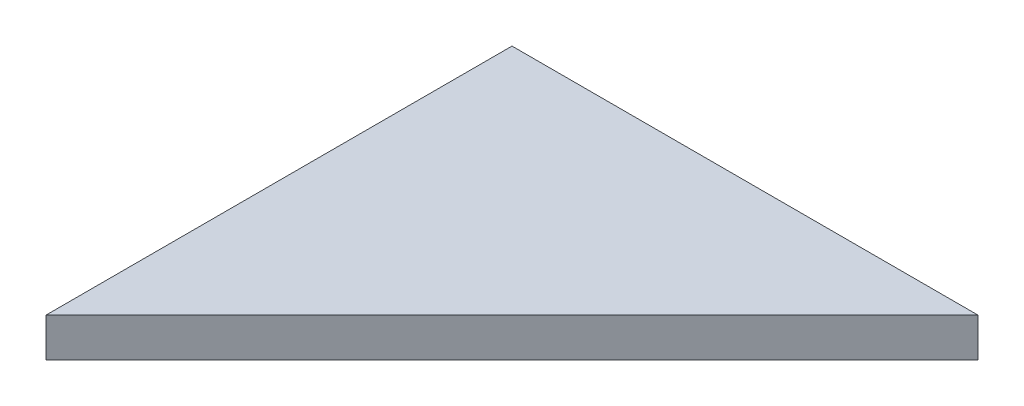
ISO-10303-21;
HEADER;
FILE_DESCRIPTION(('STEP AP214'),'2;1');
FILE_NAME('part.step','',(''),(''),'','','');
FILE_SCHEMA(('AUTOMOTIVE_DESIGN { 1 0 10303 214 1 1 1 1 }'));
ENDSEC;
DATA;
#1=APPLICATION_CONTEXT('core data for automotive mechanical design processes');
#2=APPLICATION_PROTOCOL_DEFINITION('international standard','automotive_design',2000,#1);
#3=PRODUCT_CONTEXT('',#1,'mechanical');
#4=PRODUCT('Part','Part','',(#3));
#5=PRODUCT_RELATED_PRODUCT_CATEGORY('part','',(#4));
#6=PRODUCT_DEFINITION_FORMATION('','',#4);
#7=PRODUCT_DEFINITION_CONTEXT('part definition',#1,'design');
#8=PRODUCT_DEFINITION('design','',#6,#7);
#9=PRODUCT_DEFINITION_SHAPE('','',#8);
#10=(LENGTH_UNIT() NAMED_UNIT(*) SI_UNIT(.MILLI.,.METRE.));
#11=(NAMED_UNIT(*) PLANE_ANGLE_UNIT() SI_UNIT($,.RADIAN.));
#12=(NAMED_UNIT(*) SI_UNIT($,.STERADIAN.) SOLID_ANGLE_UNIT());
#13=UNCERTAINTY_MEASURE_WITH_UNIT(LENGTH_MEASURE(1.E-05),#10,'distance_accuracy_value','');
#14=(GEOMETRIC_REPRESENTATION_CONTEXT(3) GLOBAL_UNCERTAINTY_ASSIGNED_CONTEXT((#13)) GLOBAL_UNIT_ASSIGNED_CONTEXT((#10,
#11,#12)) REPRESENTATION_CONTEXT('',''));
#15=CARTESIAN_POINT('',(0.,0.,0.));
#16=DIRECTION('',(0.,0.,1.));
#17=DIRECTION('',(1.,0.,0.));
#18=AXIS2_PLACEMENT_3D('',#15,#16,#17);
#19=CARTESIAN_POINT('',(0.,1.5875,38.1));
#20=DIRECTION('',(-0.707106781186548,0.,-0.707106781186548));
#21=DIRECTION('',(-0.707106781186548,0.,0.707106781186548));
#22=AXIS2_PLACEMENT_3D('',#19,#20,#21);
#23=PLANE('',#22);
#24=DIRECTION('',(0.707106781186547,0.,-0.707106781186547));
#25=VECTOR('',#24,1.);
#26=CARTESIAN_POINT('',(0.,-1.5875,38.1));
#27=LINE('',#26,#25);
#28=CARTESIAN_POINT('',(0.,-1.5875,38.1));
#29=VERTEX_POINT('',#28);
#30=CARTESIAN_POINT('',(38.1,-1.5875,0.));
#31=VERTEX_POINT('',#30);
#32=EDGE_CURVE('E81',#29,#31,#27,.T.);
#33=ORIENTED_EDGE('',*,*,#32,.T.);
#34=DIRECTION('',(0.,-1.,0.));
#35=VECTOR('',#34,1.);
#36=CARTESIAN_POINT('',(38.1,1.5875,0.));
#37=LINE('',#36,#35);
#38=CARTESIAN_POINT('',(38.1,1.5875,0.));
#39=VERTEX_POINT('',#38);
#40=EDGE_CURVE('E11',#39,#31,#37,.T.);
#41=ORIENTED_EDGE('',*,*,#40,.F.);
#42=DIRECTION('',(0.707106781186547,0.,-0.707106781186547));
#43=VECTOR('',#42,1.);
#44=CARTESIAN_POINT('',(0.,1.5875,38.1));
#45=LINE('',#44,#43);
#46=CARTESIAN_POINT('',(0.,1.5875,38.1));
#47=VERTEX_POINT('',#46);
#48=EDGE_CURVE('E74',#47,#39,#45,.T.);
#49=ORIENTED_EDGE('',*,*,#48,.F.);
#50=DIRECTION('',(0.,-1.,0.));
#51=VECTOR('',#50,1.);
#52=CARTESIAN_POINT('',(0.,1.5875,38.1));
#53=LINE('',#52,#51);
#54=EDGE_CURVE('E82',#47,#29,#53,.T.);
#55=ORIENTED_EDGE('',*,*,#54,.T.);
#56=EDGE_LOOP('',(#33,#41,#49,#55));
#57=FACE_BOUND('',#56,.T.);
#58=ADVANCED_FACE('F34',(#57),#23,.F.);
#59=CARTESIAN_POINT('',(38.1,1.5875,0.));
#60=DIRECTION('',(0.,0.,1.));
#61=DIRECTION('',(1.,0.,0.));
#62=AXIS2_PLACEMENT_3D('',#59,#60,#61);
#63=PLANE('',#62);
#64=DIRECTION('',(-1.,0.,0.));
#65=VECTOR('',#64,1.);
#66=CARTESIAN_POINT('',(38.1,-1.5875,0.));
#67=LINE('',#66,#65);
#68=CARTESIAN_POINT('',(0.,-1.5875,0.));
#69=VERTEX_POINT('',#68);
#70=EDGE_CURVE('E62',#31,#69,#67,.T.);
#71=ORIENTED_EDGE('',*,*,#70,.T.);
#72=DIRECTION('',(0.,-1.,0.));
#73=VECTOR('',#72,1.);
#74=CARTESIAN_POINT('',(0.,1.5875,0.));
#75=LINE('',#74,#73);
#76=CARTESIAN_POINT('',(0.,1.5875,0.));
#77=VERTEX_POINT('',#76);
#78=EDGE_CURVE('E42',#77,#69,#75,.T.);
#79=ORIENTED_EDGE('',*,*,#78,.F.);
#80=DIRECTION('',(-1.,0.,0.));
#81=VECTOR('',#80,1.);
#82=CARTESIAN_POINT('',(38.1,1.5875,0.));
#83=LINE('',#82,#81);
#84=EDGE_CURVE('E70',#39,#77,#83,.T.);
#85=ORIENTED_EDGE('',*,*,#84,.F.);
#86=ORIENTED_EDGE('',*,*,#40,.T.);
#87=EDGE_LOOP('',(#71,#79,#85,#86));
#88=FACE_BOUND('',#87,.T.);
#89=ADVANCED_FACE('F71',(#88),#63,.F.);
#90=CARTESIAN_POINT('',(0.,1.5875,0.));
#91=DIRECTION('',(1.,0.,0.));
#92=DIRECTION('',(0.,0.,-1.));
#93=AXIS2_PLACEMENT_3D('',#90,#91,#92);
#94=PLANE('',#93);
#95=DIRECTION('',(0.,0.,1.));
#96=VECTOR('',#95,1.);
#97=CARTESIAN_POINT('',(0.,-1.5875,0.));
#98=LINE('',#97,#96);
#99=EDGE_CURVE('E67',#69,#29,#98,.T.);
#100=ORIENTED_EDGE('',*,*,#99,.T.);
#101=ORIENTED_EDGE('',*,*,#54,.F.);
#102=DIRECTION('',(0.,0.,1.));
#103=VECTOR('',#102,1.);
#104=CARTESIAN_POINT('',(0.,1.5875,0.));
#105=LINE('',#104,#103);
#106=EDGE_CURVE('E50',#77,#47,#105,.T.);
#107=ORIENTED_EDGE('',*,*,#106,.F.);
#108=ORIENTED_EDGE('',*,*,#78,.T.);
#109=EDGE_LOOP('',(#100,#101,#107,#108));
#110=FACE_BOUND('',#109,.T.);
#111=ADVANCED_FACE('F89',(#110),#94,.F.);
#112=CARTESIAN_POINT('',(38.1,1.5875,0.));
#113=DIRECTION('',(0.,1.,0.));
#114=DIRECTION('',(0.,0.,1.));
#115=AXIS2_PLACEMENT_3D('',#112,#113,#114);
#116=PLANE('',#115);
#117=ORIENTED_EDGE('',*,*,#48,.T.);
#118=ORIENTED_EDGE('',*,*,#84,.T.);
#119=ORIENTED_EDGE('',*,*,#106,.T.);
#120=EDGE_LOOP('',(#117,#118,#119));
#121=FACE_BOUND('',#120,.T.);
#122=ADVANCED_FACE('F77',(#121),#116,.T.);
#123=CARTESIAN_POINT('',(38.1,-1.5875,0.));
#124=DIRECTION('',(0.,1.,0.));
#125=DIRECTION('',(0.,0.,1.));
#126=AXIS2_PLACEMENT_3D('',#123,#124,#125);
#127=PLANE('',#126);
#128=ORIENTED_EDGE('',*,*,#32,.F.);
#129=ORIENTED_EDGE('',*,*,#99,.F.);
#130=ORIENTED_EDGE('',*,*,#70,.F.);
#131=EDGE_LOOP('',(#128,#129,#130));
#132=FACE_BOUND('',#131,.T.);
#133=ADVANCED_FACE('F90',(#132),#127,.F.);
#134=CLOSED_SHELL('',(#58,#89,#111,#122,#133));
#135=MANIFOLD_SOLID_BREP('B2',#134);
#136=ADVANCED_BREP_SHAPE_REPRESENTATION('',(#18,#135),#14);
#137=SHAPE_DEFINITION_REPRESENTATION(#9,#136);
ENDSEC;
END-ISO-10303-21;
